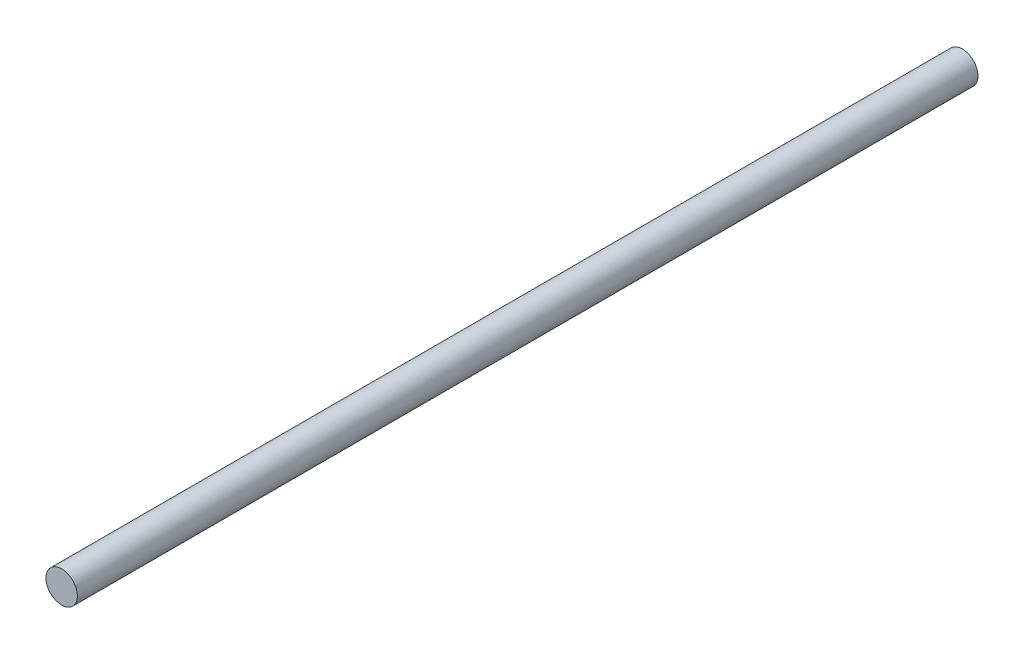
ISO-10303-21;
HEADER;
FILE_DESCRIPTION(('STEP AP214'),'2;1');
FILE_NAME('part.step','',(''),(''),'','','');
FILE_SCHEMA(('AUTOMOTIVE_DESIGN { 1 0 10303 214 1 1 1 1 }'));
ENDSEC;
DATA;
#1=APPLICATION_CONTEXT('core data for automotive mechanical design processes');
#2=APPLICATION_PROTOCOL_DEFINITION('international standard','automotive_design',2000,#1);
#3=PRODUCT_CONTEXT('',#1,'mechanical');
#4=PRODUCT('Part','Part','',(#3));
#5=PRODUCT_RELATED_PRODUCT_CATEGORY('part','',(#4));
#6=PRODUCT_DEFINITION_FORMATION('','',#4);
#7=PRODUCT_DEFINITION_CONTEXT('part definition',#1,'design');
#8=PRODUCT_DEFINITION('design','',#6,#7);
#9=PRODUCT_DEFINITION_SHAPE('','',#8);
#10=(LENGTH_UNIT() NAMED_UNIT(*) SI_UNIT(.MILLI.,.METRE.));
#11=(NAMED_UNIT(*) PLANE_ANGLE_UNIT() SI_UNIT($,.RADIAN.));
#12=(NAMED_UNIT(*) SI_UNIT($,.STERADIAN.) SOLID_ANGLE_UNIT());
#13=UNCERTAINTY_MEASURE_WITH_UNIT(LENGTH_MEASURE(1.E-05),#10,'distance_accuracy_value','');
#14=(GEOMETRIC_REPRESENTATION_CONTEXT(3) GLOBAL_UNCERTAINTY_ASSIGNED_CONTEXT((#13)) GLOBAL_UNIT_ASSIGNED_CONTEXT((#10,
#11,#12)) REPRESENTATION_CONTEXT('',''));
#15=CARTESIAN_POINT('',(0.,0.,0.));
#16=DIRECTION('',(0.,0.,1.));
#17=DIRECTION('',(1.,0.,0.));
#18=AXIS2_PLACEMENT_3D('',#15,#16,#17);
#19=CARTESIAN_POINT('',(0.,0.,286.9));
#20=DIRECTION('',(0.,0.,-1.));
#21=DIRECTION('',(-1.,0.,0.));
#22=AXIS2_PLACEMENT_3D('',#19,#20,#21);
#23=CYLINDRICAL_SURFACE('',#22,5.);
#24=CARTESIAN_POINT('',(0.,0.,286.9));
#25=DIRECTION('',(0.,0.,1.));
#26=DIRECTION('',(1.,0.,0.));
#27=AXIS2_PLACEMENT_3D('',#24,#25,#26);
#28=CIRCLE('',#27,5.);
#29=CARTESIAN_POINT('',(5.,0.,286.9));
#30=VERTEX_POINT('',#29);
#31=EDGE_CURVE('E10',#30,#30,#28,.T.);
#32=ORIENTED_EDGE('',*,*,#31,.F.);
#33=EDGE_LOOP('',(#32));
#34=FACE_BOUND('',#33,.T.);
#35=CARTESIAN_POINT('',(0.,0.,0.));
#36=DIRECTION('',(0.,0.,1.));
#37=DIRECTION('',(1.,0.,0.));
#38=AXIS2_PLACEMENT_3D('',#35,#36,#37);
#39=CIRCLE('',#38,5.);
#40=CARTESIAN_POINT('',(5.,0.,0.));
#41=VERTEX_POINT('',#40);
#42=EDGE_CURVE('E40',#41,#41,#39,.T.);
#43=ORIENTED_EDGE('',*,*,#42,.T.);
#44=EDGE_LOOP('',(#43));
#45=FACE_BOUND('',#44,.T.);
#46=ADVANCED_FACE('F37',(#34,#45),#23,.T.);
#47=CARTESIAN_POINT('',(0.,0.,286.9));
#48=DIRECTION('',(0.,0.,1.));
#49=DIRECTION('',(1.,0.,0.));
#50=AXIS2_PLACEMENT_3D('',#47,#48,#49);
#51=PLANE('',#50);
#52=ORIENTED_EDGE('',*,*,#31,.T.);
#53=EDGE_LOOP('',(#52));
#54=FACE_BOUND('',#53,.T.);
#55=ADVANCED_FACE('F54',(#54),#51,.T.);
#56=CARTESIAN_POINT('',(0.,0.,0.));
#57=DIRECTION('',(0.,0.,1.));
#58=DIRECTION('',(1.,0.,0.));
#59=AXIS2_PLACEMENT_3D('',#56,#57,#58);
#60=PLANE('',#59);
#61=ORIENTED_EDGE('',*,*,#42,.F.);
#62=EDGE_LOOP('',(#61));
#63=FACE_BOUND('',#62,.T.);
#64=ADVANCED_FACE('F52',(#63),#60,.F.);
#65=CLOSED_SHELL('',(#46,#55,#64));
#66=MANIFOLD_SOLID_BREP('B2',#65);
#67=ADVANCED_BREP_SHAPE_REPRESENTATION('',(#18,#66),#14);
#68=SHAPE_DEFINITION_REPRESENTATION(#9,#67);
ENDSEC;
END-ISO-10303-21;
